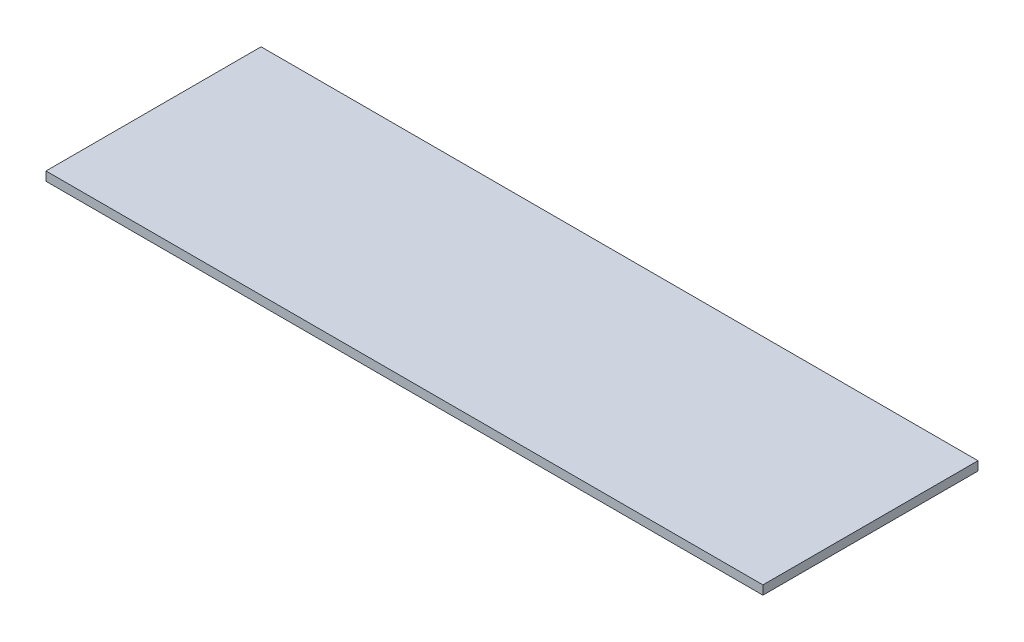
ISO-10303-21;
HEADER;
FILE_DESCRIPTION(('STEP AP214'),'2;1');
FILE_NAME('part.step','',(''),(''),'','','');
FILE_SCHEMA(('AUTOMOTIVE_DESIGN { 1 0 10303 214 1 1 1 1 }'));
ENDSEC;
DATA;
#1=APPLICATION_CONTEXT('core data for automotive mechanical design processes');
#2=APPLICATION_PROTOCOL_DEFINITION('international standard','automotive_design',2000,#1);
#3=PRODUCT_CONTEXT('',#1,'mechanical');
#4=PRODUCT('Part','Part','',(#3));
#5=PRODUCT_RELATED_PRODUCT_CATEGORY('part','',(#4));
#6=PRODUCT_DEFINITION_FORMATION('','',#4);
#7=PRODUCT_DEFINITION_CONTEXT('part definition',#1,'design');
#8=PRODUCT_DEFINITION('design','',#6,#7);
#9=PRODUCT_DEFINITION_SHAPE('','',#8);
#10=(LENGTH_UNIT() NAMED_UNIT(*) SI_UNIT(.MILLI.,.METRE.));
#11=(NAMED_UNIT(*) PLANE_ANGLE_UNIT() SI_UNIT($,.RADIAN.));
#12=(NAMED_UNIT(*) SI_UNIT($,.STERADIAN.) SOLID_ANGLE_UNIT());
#13=UNCERTAINTY_MEASURE_WITH_UNIT(LENGTH_MEASURE(1.E-05),#10,'distance_accuracy_value','');
#14=(GEOMETRIC_REPRESENTATION_CONTEXT(3) GLOBAL_UNCERTAINTY_ASSIGNED_CONTEXT((#13)) GLOBAL_UNIT_ASSIGNED_CONTEXT((#10,
#11,#12)) REPRESENTATION_CONTEXT('',''));
#15=CARTESIAN_POINT('',(0.,0.,0.));
#16=DIRECTION('',(0.,0.,1.));
#17=DIRECTION('',(1.,0.,0.));
#18=AXIS2_PLACEMENT_3D('',#15,#16,#17);
#19=CARTESIAN_POINT('',(508.,6.35,-152.4));
#20=DIRECTION('',(-1.,0.,0.));
#21=DIRECTION('',(0.,0.,1.));
#22=AXIS2_PLACEMENT_3D('',#19,#20,#21);
#23=PLANE('',#22);
#24=DIRECTION('',(0.,0.,-1.));
#25=VECTOR('',#24,1.);
#26=CARTESIAN_POINT('',(508.,0.,-152.4));
#27=LINE('',#26,#25);
#28=CARTESIAN_POINT('',(508.,0.,0.));
#29=VERTEX_POINT('',#28);
#30=CARTESIAN_POINT('',(508.,0.,-152.4));
#31=VERTEX_POINT('',#30);
#32=EDGE_CURVE('E99',#29,#31,#27,.T.);
#33=ORIENTED_EDGE('',*,*,#32,.T.);
#34=DIRECTION('',(0.,-1.,0.));
#35=VECTOR('',#34,1.);
#36=CARTESIAN_POINT('',(508.,6.35,-152.4));
#37=LINE('',#36,#35);
#38=CARTESIAN_POINT('',(508.,6.35,-152.4));
#39=VERTEX_POINT('',#38);
#40=EDGE_CURVE('E11',#39,#31,#37,.T.);
#41=ORIENTED_EDGE('',*,*,#40,.F.);
#42=DIRECTION('',(0.,0.,-1.));
#43=VECTOR('',#42,1.);
#44=CARTESIAN_POINT('',(508.,6.35,-152.4));
#45=LINE('',#44,#43);
#46=CARTESIAN_POINT('',(508.,6.35,0.));
#47=VERTEX_POINT('',#46);
#48=EDGE_CURVE('E87',#47,#39,#45,.T.);
#49=ORIENTED_EDGE('',*,*,#48,.F.);
#50=DIRECTION('',(0.,-1.,0.));
#51=VECTOR('',#50,1.);
#52=CARTESIAN_POINT('',(508.,6.35,0.));
#53=LINE('',#52,#51);
#54=EDGE_CURVE('E95',#47,#29,#53,.T.);
#55=ORIENTED_EDGE('',*,*,#54,.T.);
#56=EDGE_LOOP('',(#33,#41,#49,#55));
#57=FACE_BOUND('',#56,.T.);
#58=ADVANCED_FACE('F36',(#57),#23,.F.);
#59=CARTESIAN_POINT('',(508.,6.35,-152.4));
#60=DIRECTION('',(0.,0.,1.));
#61=DIRECTION('',(1.,0.,0.));
#62=AXIS2_PLACEMENT_3D('',#59,#60,#61);
#63=PLANE('',#62);
#64=DIRECTION('',(-1.,0.,0.));
#65=VECTOR('',#64,1.);
#66=CARTESIAN_POINT('',(508.,0.,-152.4));
#67=LINE('',#66,#65);
#68=CARTESIAN_POINT('',(0.,0.,-152.4));
#69=VERTEX_POINT('',#68);
#70=EDGE_CURVE('E91',#31,#69,#67,.T.);
#71=ORIENTED_EDGE('',*,*,#70,.T.);
#72=DIRECTION('',(0.,-1.,0.));
#73=VECTOR('',#72,1.);
#74=CARTESIAN_POINT('',(0.,6.35,-152.4));
#75=LINE('',#74,#73);
#76=CARTESIAN_POINT('',(0.,6.35,-152.4));
#77=VERTEX_POINT('',#76);
#78=EDGE_CURVE('E44',#77,#69,#75,.T.);
#79=ORIENTED_EDGE('',*,*,#78,.F.);
#80=DIRECTION('',(-1.,0.,0.));
#81=VECTOR('',#80,1.);
#82=CARTESIAN_POINT('',(508.,6.35,-152.4));
#83=LINE('',#82,#81);
#84=EDGE_CURVE('E82',#39,#77,#83,.T.);
#85=ORIENTED_EDGE('',*,*,#84,.F.);
#86=ORIENTED_EDGE('',*,*,#40,.T.);
#87=EDGE_LOOP('',(#71,#79,#85,#86));
#88=FACE_BOUND('',#87,.T.);
#89=ADVANCED_FACE('F90',(#88),#63,.F.);
#90=CARTESIAN_POINT('',(0.,6.35,-152.4));
#91=DIRECTION('',(1.,0.,0.));
#92=DIRECTION('',(0.,0.,-1.));
#93=AXIS2_PLACEMENT_3D('',#90,#91,#92);
#94=PLANE('',#93);
#95=DIRECTION('',(0.,0.,1.));
#96=VECTOR('',#95,1.);
#97=CARTESIAN_POINT('',(0.,0.,-152.4));
#98=LINE('',#97,#96);
#99=CARTESIAN_POINT('',(0.,0.,0.));
#100=VERTEX_POINT('',#99);
#101=EDGE_CURVE('E69',#69,#100,#98,.T.);
#102=ORIENTED_EDGE('',*,*,#101,.T.);
#103=DIRECTION('',(0.,-1.,0.));
#104=VECTOR('',#103,1.);
#105=CARTESIAN_POINT('',(0.,6.35,0.));
#106=LINE('',#105,#104);
#107=CARTESIAN_POINT('',(0.,6.35,0.));
#108=VERTEX_POINT('',#107);
#109=EDGE_CURVE('E92',#108,#100,#106,.T.);
#110=ORIENTED_EDGE('',*,*,#109,.F.);
#111=DIRECTION('',(0.,0.,1.));
#112=VECTOR('',#111,1.);
#113=CARTESIAN_POINT('',(0.,6.35,-152.4));
#114=LINE('',#113,#112);
#115=EDGE_CURVE('E85',#77,#108,#114,.T.);
#116=ORIENTED_EDGE('',*,*,#115,.F.);
#117=ORIENTED_EDGE('',*,*,#78,.T.);
#118=EDGE_LOOP('',(#102,#110,#116,#117));
#119=FACE_BOUND('',#118,.T.);
#120=ADVANCED_FACE('F93',(#119),#94,.F.);
#121=CARTESIAN_POINT('',(508.,6.35,0.));
#122=DIRECTION('',(0.,0.,-1.));
#123=DIRECTION('',(-1.,0.,0.));
#124=AXIS2_PLACEMENT_3D('',#121,#122,#123);
#125=PLANE('',#124);
#126=DIRECTION('',(1.,0.,0.));
#127=VECTOR('',#126,1.);
#128=CARTESIAN_POINT('',(508.,0.,0.));
#129=LINE('',#128,#127);
#130=EDGE_CURVE('E75',#100,#29,#129,.T.);
#131=ORIENTED_EDGE('',*,*,#130,.T.);
#132=ORIENTED_EDGE('',*,*,#54,.F.);
#133=DIRECTION('',(1.,0.,0.));
#134=VECTOR('',#133,1.);
#135=CARTESIAN_POINT('',(508.,6.35,0.));
#136=LINE('',#135,#134);
#137=EDGE_CURVE('E52',#108,#47,#136,.T.);
#138=ORIENTED_EDGE('',*,*,#137,.F.);
#139=ORIENTED_EDGE('',*,*,#109,.T.);
#140=EDGE_LOOP('',(#131,#132,#138,#139));
#141=FACE_BOUND('',#140,.T.);
#142=ADVANCED_FACE('F106',(#141),#125,.F.);
#143=CARTESIAN_POINT('',(0.,6.35,0.));
#144=DIRECTION('',(0.,-1.,0.));
#145=DIRECTION('',(0.,0.,-1.));
#146=AXIS2_PLACEMENT_3D('',#143,#144,#145);
#147=PLANE('',#146);
#148=ORIENTED_EDGE('',*,*,#48,.T.);
#149=ORIENTED_EDGE('',*,*,#84,.T.);
#150=ORIENTED_EDGE('',*,*,#115,.T.);
#151=ORIENTED_EDGE('',*,*,#137,.T.);
#152=EDGE_LOOP('',(#148,#149,#150,#151));
#153=FACE_BOUND('',#152,.T.);
#154=ADVANCED_FACE('F83',(#153),#147,.F.);
#155=CARTESIAN_POINT('',(0.,0.,0.));
#156=DIRECTION('',(0.,-1.,0.));
#157=DIRECTION('',(0.,0.,-1.));
#158=AXIS2_PLACEMENT_3D('',#155,#156,#157);
#159=PLANE('',#158);
#160=ORIENTED_EDGE('',*,*,#32,.F.);
#161=ORIENTED_EDGE('',*,*,#130,.F.);
#162=ORIENTED_EDGE('',*,*,#101,.F.);
#163=ORIENTED_EDGE('',*,*,#70,.F.);
#164=EDGE_LOOP('',(#160,#161,#162,#163));
#165=FACE_BOUND('',#164,.T.);
#166=ADVANCED_FACE('F109',(#165),#159,.T.);
#167=CLOSED_SHELL('',(#58,#89,#120,#142,#154,#166));
#168=MANIFOLD_SOLID_BREP('B2',#167);
#169=ADVANCED_BREP_SHAPE_REPRESENTATION('',(#18,#168),#14);
#170=SHAPE_DEFINITION_REPRESENTATION(#9,#169);
ENDSEC;
END-ISO-10303-21;
